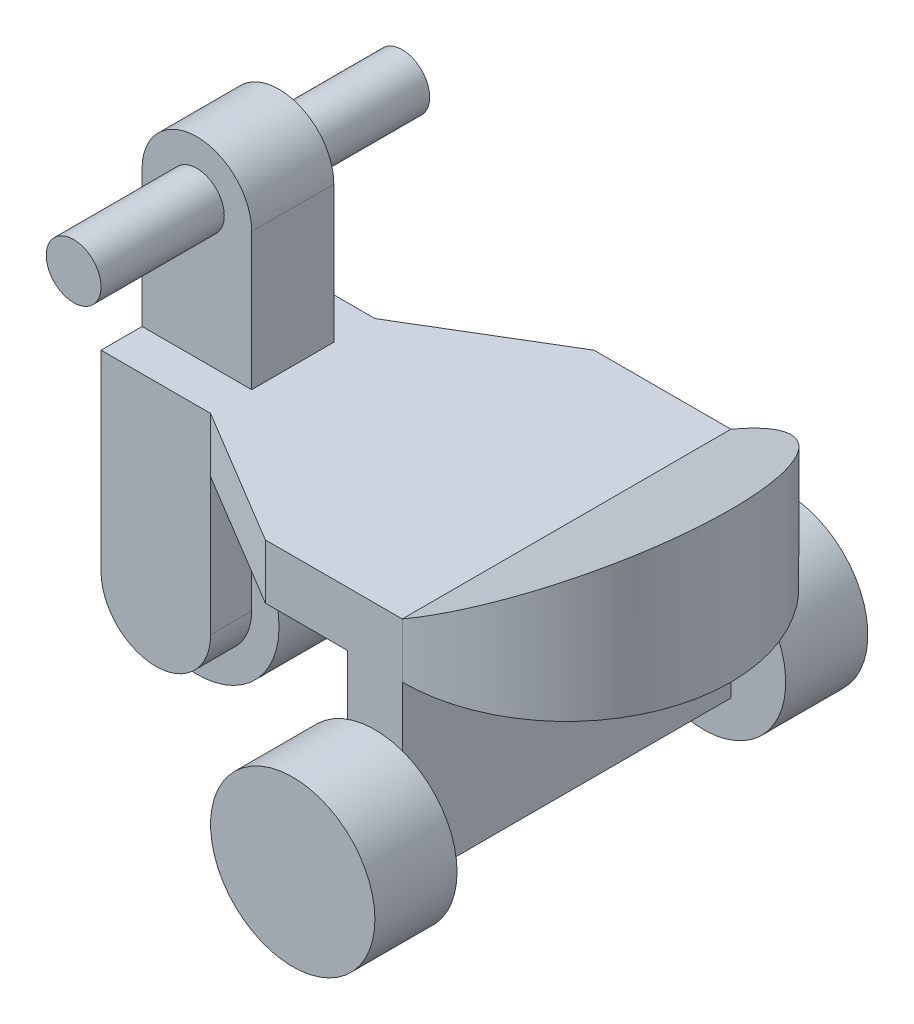
ISO-10303-21;
HEADER;
FILE_DESCRIPTION(('STEP AP214'),'2;1');
FILE_NAME('part.step','',(''),(''),'','','');
FILE_SCHEMA(('AUTOMOTIVE_DESIGN { 1 0 10303 214 1 1 1 1 }'));
ENDSEC;
DATA;
#1=APPLICATION_CONTEXT('core data for automotive mechanical design processes');
#2=APPLICATION_PROTOCOL_DEFINITION('international standard','automotive_design',2000,#1);
#3=PRODUCT_CONTEXT('',#1,'mechanical');
#4=PRODUCT('Part','Part','',(#3));
#5=PRODUCT_RELATED_PRODUCT_CATEGORY('part','',(#4));
#6=PRODUCT_DEFINITION_FORMATION('','',#4);
#7=PRODUCT_DEFINITION_CONTEXT('part definition',#1,'design');
#8=PRODUCT_DEFINITION('design','',#6,#7);
#9=PRODUCT_DEFINITION_SHAPE('','',#8);
#10=(LENGTH_UNIT() NAMED_UNIT(*) SI_UNIT(.MILLI.,.METRE.));
#11=(NAMED_UNIT(*) PLANE_ANGLE_UNIT() SI_UNIT($,.RADIAN.));
#12=(NAMED_UNIT(*) SI_UNIT($,.STERADIAN.) SOLID_ANGLE_UNIT());
#13=UNCERTAINTY_MEASURE_WITH_UNIT(LENGTH_MEASURE(1.E-05),#10,'distance_accuracy_value','');
#14=(GEOMETRIC_REPRESENTATION_CONTEXT(3) GLOBAL_UNCERTAINTY_ASSIGNED_CONTEXT((#13)) GLOBAL_UNIT_ASSIGNED_CONTEXT((#10,
#11,#12)) REPRESENTATION_CONTEXT('',''));
#15=CARTESIAN_POINT('',(0.,0.,0.));
#16=DIRECTION('',(0.,0.,1.));
#17=DIRECTION('',(1.,0.,0.));
#18=AXIS2_PLACEMENT_3D('',#15,#16,#17);
#19=CARTESIAN_POINT('',(-120.,70.,-60.));
#20=DIRECTION('',(0.,0.,1.));
#21=DIRECTION('',(1.,0.,0.));
#22=AXIS2_PLACEMENT_3D('',#19,#20,#21);
#23=CYLINDRICAL_SURFACE('',#22,9.99999999999999);
#24=CARTESIAN_POINT('',(-120.,70.,-60.));
#25=DIRECTION('',(0.,0.,-1.));
#26=DIRECTION('',(-1.,0.,0.));
#27=AXIS2_PLACEMENT_3D('',#24,#25,#26);
#28=CIRCLE('',#27,9.99999999999999);
#29=CARTESIAN_POINT('',(-130.,70.,-60.));
#30=VERTEX_POINT('',#29);
#31=EDGE_CURVE('E11',#30,#30,#28,.T.);
#32=ORIENTED_EDGE('',*,*,#31,.F.);
#33=EDGE_LOOP('',(#32));
#34=FACE_BOUND('',#33,.T.);
#35=CARTESIAN_POINT('',(-120.,70.,-15.));
#36=DIRECTION('',(0.,0.,-1.));
#37=DIRECTION('',(-1.,0.,0.));
#38=AXIS2_PLACEMENT_3D('',#35,#36,#37);
#39=CIRCLE('',#38,9.99999999999999);
#40=CARTESIAN_POINT('',(-130.,70.,-15.));
#41=VERTEX_POINT('',#40);
#42=EDGE_CURVE('E47',#41,#41,#39,.T.);
#43=ORIENTED_EDGE('',*,*,#42,.T.);
#44=EDGE_LOOP('',(#43));
#45=FACE_BOUND('',#44,.T.);
#46=ADVANCED_FACE('F41',(#34,#45),#23,.T.);
#47=CARTESIAN_POINT('',(-120.,70.,-60.));
#48=DIRECTION('',(0.,0.,-1.));
#49=DIRECTION('',(-1.,0.,0.));
#50=AXIS2_PLACEMENT_3D('',#47,#48,#49);
#51=PLANE('',#50);
#52=ORIENTED_EDGE('',*,*,#31,.T.);
#53=EDGE_LOOP('',(#52));
#54=FACE_BOUND('',#53,.T.);
#55=ADVANCED_FACE('F56',(#54),#51,.T.);
#56=CARTESIAN_POINT('',(-120.,70.,-15.));
#57=DIRECTION('',(0.,0.,-1.));
#58=DIRECTION('',(-1.,0.,0.));
#59=AXIS2_PLACEMENT_3D('',#56,#57,#58);
#60=PLANE('',#59);
#61=ORIENTED_EDGE('',*,*,#42,.F.);
#62=EDGE_LOOP('',(#61));
#63=FACE_BOUND('',#62,.T.);
#64=ADVANCED_FACE('F54',(#63),#60,.F.);
#65=CLOSED_SHELL('',(#46,#55,#64));
#66=MANIFOLD_SOLID_BREP('B2',#65);
#67=CARTESIAN_POINT('',(-120.,70.,60.));
#68=DIRECTION('',(0.,0.,-1.));
#69=DIRECTION('',(-1.,0.,0.));
#70=AXIS2_PLACEMENT_3D('',#67,#68,#69);
#71=CYLINDRICAL_SURFACE('',#70,9.99999999999999);
#72=CARTESIAN_POINT('',(-120.,70.,60.));
#73=DIRECTION('',(0.,0.,1.));
#74=DIRECTION('',(1.,0.,0.));
#75=AXIS2_PLACEMENT_3D('',#72,#73,#74);
#76=CIRCLE('',#75,9.99999999999999);
#77=CARTESIAN_POINT('',(-110.,70.,60.));
#78=VERTEX_POINT('',#77);
#79=EDGE_CURVE('E40',#78,#78,#76,.T.);
#80=ORIENTED_EDGE('',*,*,#79,.F.);
#81=EDGE_LOOP('',(#80));
#82=FACE_BOUND('',#81,.T.);
#83=CARTESIAN_POINT('',(-120.,70.,15.));
#84=DIRECTION('',(0.,0.,1.));
#85=DIRECTION('',(1.,0.,0.));
#86=AXIS2_PLACEMENT_3D('',#83,#84,#85);
#87=CIRCLE('',#86,9.99999999999999);
#88=CARTESIAN_POINT('',(-110.,70.,15.));
#89=VERTEX_POINT('',#88);
#90=EDGE_CURVE('E97',#89,#89,#87,.T.);
#91=ORIENTED_EDGE('',*,*,#90,.T.);
#92=EDGE_LOOP('',(#91));
#93=FACE_BOUND('',#92,.T.);
#94=ADVANCED_FACE('F91',(#82,#93),#71,.T.);
#95=CARTESIAN_POINT('',(-120.,70.,60.));
#96=DIRECTION('',(0.,0.,1.));
#97=DIRECTION('',(1.,0.,0.));
#98=AXIS2_PLACEMENT_3D('',#95,#96,#97);
#99=PLANE('',#98);
#100=ORIENTED_EDGE('',*,*,#79,.T.);
#101=EDGE_LOOP('',(#100));
#102=FACE_BOUND('',#101,.T.);
#103=ADVANCED_FACE('F106',(#102),#99,.T.);
#104=CARTESIAN_POINT('',(-120.,70.,15.));
#105=DIRECTION('',(0.,0.,1.));
#106=DIRECTION('',(1.,0.,0.));
#107=AXIS2_PLACEMENT_3D('',#104,#105,#106);
#108=PLANE('',#107);
#109=ORIENTED_EDGE('',*,*,#90,.F.);
#110=EDGE_LOOP('',(#109));
#111=FACE_BOUND('',#110,.T.);
#112=ADVANCED_FACE('F104',(#111),#108,.F.);
#113=CLOSED_SHELL('',(#94,#103,#112));
#114=MANIFOLD_SOLID_BREP('B6',#113);
#115=CARTESIAN_POINT('',(-100.,70.,-15.));
#116=DIRECTION('',(-1.,0.,0.));
#117=DIRECTION('',(0.,0.,1.));
#118=AXIS2_PLACEMENT_3D('',#115,#116,#117);
#119=PLANE('',#118);
#120=DIRECTION('',(0.,-1.,0.));
#121=VECTOR('',#120,1.);
#122=CARTESIAN_POINT('',(-100.,70.,15.));
#123=LINE('',#122,#121);
#124=CARTESIAN_POINT('',(-100.,70.,15.));
#125=VERTEX_POINT('',#124);
#126=CARTESIAN_POINT('',(-100.,0.,15.));
#127=VERTEX_POINT('',#126);
#128=EDGE_CURVE('E180',#125,#127,#123,.T.);
#129=ORIENTED_EDGE('',*,*,#128,.T.);
#130=DIRECTION('',(0.,0.,-1.));
#131=VECTOR('',#130,1.);
#132=CARTESIAN_POINT('',(-100.,0.,-15.));
#133=LINE('',#132,#131);
#134=CARTESIAN_POINT('',(-100.,0.,-15.));
#135=VERTEX_POINT('',#134);
#136=EDGE_CURVE('E198',#127,#135,#133,.T.);
#137=ORIENTED_EDGE('',*,*,#136,.T.);
#138=DIRECTION('',(0.,-1.,0.));
#139=VECTOR('',#138,1.);
#140=CARTESIAN_POINT('',(-100.,70.,-15.));
#141=LINE('',#140,#139);
#142=CARTESIAN_POINT('',(-100.,70.,-15.));
#143=VERTEX_POINT('',#142);
#144=EDGE_CURVE('E89',#143,#135,#141,.T.);
#145=ORIENTED_EDGE('',*,*,#144,.F.);
#146=DIRECTION('',(0.,0.,-1.));
#147=VECTOR('',#146,1.);
#148=CARTESIAN_POINT('',(-100.,70.,-15.));
#149=LINE('',#148,#147);
#150=EDGE_CURVE('E177',#125,#143,#149,.T.);
#151=ORIENTED_EDGE('',*,*,#150,.F.);
#152=EDGE_LOOP('',(#129,#137,#145,#151));
#153=FACE_BOUND('',#152,.T.);
#154=ADVANCED_FACE('F139',(#153),#119,.F.);
#155=CARTESIAN_POINT('',(-100.,70.,-15.));
#156=DIRECTION('',(0.,0.,1.));
#157=DIRECTION('',(1.,0.,0.));
#158=AXIS2_PLACEMENT_3D('',#155,#156,#157);
#159=PLANE('',#158);
#160=DIRECTION('',(0.,-1.,0.));
#161=VECTOR('',#160,1.);
#162=CARTESIAN_POINT('',(-140.,70.,-15.));
#163=LINE('',#162,#161);
#164=CARTESIAN_POINT('',(-140.,70.,-15.));
#165=VERTEX_POINT('',#164);
#166=CARTESIAN_POINT('',(-140.,0.,-15.));
#167=VERTEX_POINT('',#166);
#168=EDGE_CURVE('E146',#165,#167,#163,.T.);
#169=ORIENTED_EDGE('',*,*,#168,.F.);
#170=CARTESIAN_POINT('',(-120.,70.,-15.));
#171=DIRECTION('',(0.,0.,1.));
#172=DIRECTION('',(1.,0.,0.));
#173=AXIS2_PLACEMENT_3D('',#170,#171,#172);
#174=CIRCLE('',#173,20.);
#175=EDGE_CURVE('E196',#143,#165,#174,.T.);
#176=ORIENTED_EDGE('',*,*,#175,.F.);
#177=ORIENTED_EDGE('',*,*,#144,.T.);
#178=DIRECTION('',(-1.,0.,0.));
#179=VECTOR('',#178,1.);
#180=CARTESIAN_POINT('',(-100.,0.,-15.));
#181=LINE('',#180,#179);
#182=EDGE_CURVE('E202',#135,#167,#181,.T.);
#183=ORIENTED_EDGE('',*,*,#182,.T.);
#184=EDGE_LOOP('',(#169,#176,#177,#183));
#185=FACE_BOUND('',#184,.T.);
#186=ADVANCED_FACE('F213',(#185),#159,.F.);
#187=CARTESIAN_POINT('',(-140.,70.,-15.));
#188=DIRECTION('',(1.,0.,0.));
#189=DIRECTION('',(0.,0.,-1.));
#190=AXIS2_PLACEMENT_3D('',#187,#188,#189);
#191=PLANE('',#190);
#192=ORIENTED_EDGE('',*,*,#168,.T.);
#193=DIRECTION('',(0.,0.,1.));
#194=VECTOR('',#193,1.);
#195=CARTESIAN_POINT('',(-140.,0.,-15.));
#196=LINE('',#195,#194);
#197=CARTESIAN_POINT('',(-140.,0.,15.));
#198=VERTEX_POINT('',#197);
#199=EDGE_CURVE('E204',#167,#198,#196,.T.);
#200=ORIENTED_EDGE('',*,*,#199,.T.);
#201=DIRECTION('',(0.,-1.,0.));
#202=VECTOR('',#201,1.);
#203=CARTESIAN_POINT('',(-140.,70.,15.));
#204=LINE('',#203,#202);
#205=CARTESIAN_POINT('',(-140.,70.,15.));
#206=VERTEX_POINT('',#205);
#207=EDGE_CURVE('E153',#206,#198,#204,.T.);
#208=ORIENTED_EDGE('',*,*,#207,.F.);
#209=DIRECTION('',(0.,0.,1.));
#210=VECTOR('',#209,1.);
#211=CARTESIAN_POINT('',(-140.,70.,-15.));
#212=LINE('',#211,#210);
#213=EDGE_CURVE('E185',#165,#206,#212,.T.);
#214=ORIENTED_EDGE('',*,*,#213,.F.);
#215=EDGE_LOOP('',(#192,#200,#208,#214));
#216=FACE_BOUND('',#215,.T.);
#217=ADVANCED_FACE('F209',(#216),#191,.F.);
#218=CARTESIAN_POINT('',(-100.,70.,15.));
#219=DIRECTION('',(0.,0.,-1.));
#220=DIRECTION('',(-1.,0.,0.));
#221=AXIS2_PLACEMENT_3D('',#218,#219,#220);
#222=PLANE('',#221);
#223=ORIENTED_EDGE('',*,*,#128,.F.);
#224=CARTESIAN_POINT('',(-120.,70.,15.));
#225=DIRECTION('',(0.,0.,1.));
#226=DIRECTION('',(1.,0.,0.));
#227=AXIS2_PLACEMENT_3D('',#224,#225,#226);
#228=CIRCLE('',#227,20.);
#229=EDGE_CURVE('E192',#125,#206,#228,.T.);
#230=ORIENTED_EDGE('',*,*,#229,.T.);
#231=ORIENTED_EDGE('',*,*,#207,.T.);
#232=DIRECTION('',(1.,0.,0.));
#233=VECTOR('',#232,1.);
#234=CARTESIAN_POINT('',(-100.,0.,15.));
#235=LINE('',#234,#233);
#236=EDGE_CURVE('E186',#198,#127,#235,.T.);
#237=ORIENTED_EDGE('',*,*,#236,.T.);
#238=EDGE_LOOP('',(#223,#230,#231,#237));
#239=FACE_BOUND('',#238,.T.);
#240=ADVANCED_FACE('F191',(#239),#222,.F.);
#241=CARTESIAN_POINT('',(-100.,0.,15.));
#242=DIRECTION('',(0.,-1.,0.));
#243=DIRECTION('',(0.,0.,-1.));
#244=AXIS2_PLACEMENT_3D('',#241,#242,#243);
#245=PLANE('',#244);
#246=ORIENTED_EDGE('',*,*,#136,.F.);
#247=ORIENTED_EDGE('',*,*,#236,.F.);
#248=ORIENTED_EDGE('',*,*,#199,.F.);
#249=ORIENTED_EDGE('',*,*,#182,.F.);
#250=EDGE_LOOP('',(#246,#247,#248,#249));
#251=FACE_BOUND('',#250,.T.);
#252=ADVANCED_FACE('F212',(#251),#245,.T.);
#253=CARTESIAN_POINT('',(-120.,70.,-15.));
#254=DIRECTION('',(0.,0.,1.));
#255=DIRECTION('',(1.,0.,0.));
#256=AXIS2_PLACEMENT_3D('',#253,#254,#255);
#257=CYLINDRICAL_SURFACE('',#256,20.);
#258=ORIENTED_EDGE('',*,*,#150,.T.);
#259=ORIENTED_EDGE('',*,*,#175,.T.);
#260=ORIENTED_EDGE('',*,*,#213,.T.);
#261=ORIENTED_EDGE('',*,*,#229,.F.);
#262=EDGE_LOOP('',(#258,#259,#260,#261));
#263=FACE_BOUND('',#262,.T.);
#264=ADVANCED_FACE('F195',(#263),#257,.T.);
#265=CLOSED_SHELL('',(#154,#186,#217,#240,#252,#264));
#266=MANIFOLD_SOLID_BREP('B35',#265);
#267=CARTESIAN_POINT('',(-120.,-50.,15.));
#268=DIRECTION('',(0.,0.,-1.));
#269=DIRECTION('',(-1.,0.,0.));
#270=AXIS2_PLACEMENT_3D('',#267,#268,#269);
#271=CYLINDRICAL_SURFACE('',#270,30.);
#272=CARTESIAN_POINT('',(-120.,-50.,15.));
#273=DIRECTION('',(0.,0.,1.));
#274=DIRECTION('',(1.,0.,0.));
#275=AXIS2_PLACEMENT_3D('',#272,#273,#274);
#276=CIRCLE('',#275,30.);
#277=CARTESIAN_POINT('',(-90.,-50.,15.));
#278=VERTEX_POINT('',#277);
#279=EDGE_CURVE('E138',#278,#278,#276,.T.);
#280=ORIENTED_EDGE('',*,*,#279,.F.);
#281=EDGE_LOOP('',(#280));
#282=FACE_BOUND('',#281,.T.);
#283=CARTESIAN_POINT('',(-120.,-50.,-15.));
#284=DIRECTION('',(0.,0.,1.));
#285=DIRECTION('',(1.,0.,0.));
#286=AXIS2_PLACEMENT_3D('',#283,#284,#285);
#287=CIRCLE('',#286,30.);
#288=CARTESIAN_POINT('',(-90.,-50.,-15.));
#289=VERTEX_POINT('',#288);
#290=EDGE_CURVE('E287',#289,#289,#287,.T.);
#291=ORIENTED_EDGE('',*,*,#290,.T.);
#292=EDGE_LOOP('',(#291));
#293=FACE_BOUND('',#292,.T.);
#294=ADVANCED_FACE('F281',(#282,#293),#271,.T.);
#295=CARTESIAN_POINT('',(-120.,-50.,15.));
#296=DIRECTION('',(0.,0.,1.));
#297=DIRECTION('',(1.,0.,0.));
#298=AXIS2_PLACEMENT_3D('',#295,#296,#297);
#299=PLANE('',#298);
#300=ORIENTED_EDGE('',*,*,#279,.T.);
#301=EDGE_LOOP('',(#300));
#302=FACE_BOUND('',#301,.T.);
#303=ADVANCED_FACE('F296',(#302),#299,.T.);
#304=CARTESIAN_POINT('',(-120.,-50.,-15.));
#305=DIRECTION('',(0.,0.,1.));
#306=DIRECTION('',(1.,0.,0.));
#307=AXIS2_PLACEMENT_3D('',#304,#305,#306);
#308=PLANE('',#307);
#309=ORIENTED_EDGE('',*,*,#290,.F.);
#310=EDGE_LOOP('',(#309));
#311=FACE_BOUND('',#310,.T.);
#312=ADVANCED_FACE('F294',(#311),#308,.F.);
#313=CLOSED_SHELL('',(#294,#303,#312));
#314=MANIFOLD_SOLID_BREP('B83',#313);
#315=CARTESIAN_POINT('',(-10.,-50.,-90.));
#316=DIRECTION('',(0.,0.,1.));
#317=DIRECTION('',(1.,0.,0.));
#318=AXIS2_PLACEMENT_3D('',#315,#316,#317);
#319=CYLINDRICAL_SURFACE('',#318,30.);
#320=CARTESIAN_POINT('',(-10.,-50.,-90.));
#321=DIRECTION('',(0.,0.,-1.));
#322=DIRECTION('',(-1.,0.,0.));
#323=AXIS2_PLACEMENT_3D('',#320,#321,#322);
#324=CIRCLE('',#323,30.);
#325=CARTESIAN_POINT('',(-40.,-50.,-90.));
#326=VERTEX_POINT('',#325);
#327=EDGE_CURVE('E280',#326,#326,#324,.T.);
#328=ORIENTED_EDGE('',*,*,#327,.F.);
#329=EDGE_LOOP('',(#328));
#330=FACE_BOUND('',#329,.T.);
#331=CARTESIAN_POINT('',(-9.99999999999999,-50.,-60.));
#332=DIRECTION('',(0.,0.,-1.));
#333=DIRECTION('',(-1.,0.,0.));
#334=AXIS2_PLACEMENT_3D('',#331,#332,#333);
#335=CIRCLE('',#334,30.);
#336=CARTESIAN_POINT('',(-40.,-50.,-60.));
#337=VERTEX_POINT('',#336);
#338=EDGE_CURVE('E335',#337,#337,#335,.T.);
#339=ORIENTED_EDGE('',*,*,#338,.T.);
#340=EDGE_LOOP('',(#339));
#341=FACE_BOUND('',#340,.T.);
#342=ADVANCED_FACE('F329',(#330,#341),#319,.T.);
#343=CARTESIAN_POINT('',(-10.,-50.,-90.));
#344=DIRECTION('',(0.,0.,-1.));
#345=DIRECTION('',(-1.,0.,0.));
#346=AXIS2_PLACEMENT_3D('',#343,#344,#345);
#347=PLANE('',#346);
#348=ORIENTED_EDGE('',*,*,#327,.T.);
#349=EDGE_LOOP('',(#348));
#350=FACE_BOUND('',#349,.T.);
#351=ADVANCED_FACE('F344',(#350),#347,.T.);
#352=CARTESIAN_POINT('',(-9.99999999999999,-50.,-60.));
#353=DIRECTION('',(0.,0.,-1.));
#354=DIRECTION('',(-1.,0.,0.));
#355=AXIS2_PLACEMENT_3D('',#352,#353,#354);
#356=PLANE('',#355);
#357=ORIENTED_EDGE('',*,*,#338,.F.);
#358=EDGE_LOOP('',(#357));
#359=FACE_BOUND('',#358,.T.);
#360=ADVANCED_FACE('F342',(#359),#356,.F.);
#361=CLOSED_SHELL('',(#342,#351,#360));
#362=MANIFOLD_SOLID_BREP('B133',#361);
#363=CARTESIAN_POINT('',(-9.99999999999999,-50.,90.));
#364=DIRECTION('',(0.,0.,-1.));
#365=DIRECTION('',(-1.,0.,0.));
#366=AXIS2_PLACEMENT_3D('',#363,#364,#365);
#367=CYLINDRICAL_SURFACE('',#366,30.);
#368=CARTESIAN_POINT('',(-9.99999999999999,-50.,90.));
#369=DIRECTION('',(0.,0.,1.));
#370=DIRECTION('',(1.,0.,0.));
#371=AXIS2_PLACEMENT_3D('',#368,#369,#370);
#372=CIRCLE('',#371,30.);
#373=CARTESIAN_POINT('',(20.,-50.,90.));
#374=VERTEX_POINT('',#373);
#375=EDGE_CURVE('E328',#374,#374,#372,.T.);
#376=ORIENTED_EDGE('',*,*,#375,.F.);
#377=EDGE_LOOP('',(#376));
#378=FACE_BOUND('',#377,.T.);
#379=CARTESIAN_POINT('',(-9.99999999999999,-50.,60.));
#380=DIRECTION('',(0.,0.,1.));
#381=DIRECTION('',(1.,0.,0.));
#382=AXIS2_PLACEMENT_3D('',#379,#380,#381);
#383=CIRCLE('',#382,30.);
#384=CARTESIAN_POINT('',(20.,-50.,60.));
#385=VERTEX_POINT('',#384);
#386=EDGE_CURVE('E384',#385,#385,#383,.T.);
#387=ORIENTED_EDGE('',*,*,#386,.T.);
#388=EDGE_LOOP('',(#387));
#389=FACE_BOUND('',#388,.T.);
#390=ADVANCED_FACE('F378',(#378,#389),#367,.T.);
#391=CARTESIAN_POINT('',(-9.99999999999999,-50.,90.));
#392=DIRECTION('',(0.,0.,1.));
#393=DIRECTION('',(1.,0.,0.));
#394=AXIS2_PLACEMENT_3D('',#391,#392,#393);
#395=PLANE('',#394);
#396=ORIENTED_EDGE('',*,*,#375,.T.);
#397=EDGE_LOOP('',(#396));
#398=FACE_BOUND('',#397,.T.);
#399=ADVANCED_FACE('F393',(#398),#395,.T.);
#400=CARTESIAN_POINT('',(-9.99999999999999,-50.,60.));
#401=DIRECTION('',(0.,0.,1.));
#402=DIRECTION('',(1.,0.,0.));
#403=AXIS2_PLACEMENT_3D('',#400,#401,#402);
#404=PLANE('',#403);
#405=ORIENTED_EDGE('',*,*,#386,.F.);
#406=EDGE_LOOP('',(#405));
#407=FACE_BOUND('',#406,.T.);
#408=ADVANCED_FACE('F391',(#407),#404,.F.);
#409=CLOSED_SHELL('',(#390,#399,#408));
#410=MANIFOLD_SOLID_BREP('B275',#409);
#411=CARTESIAN_POINT('',(0.,0.,0.));
#412=DIRECTION('',(0.,1.,0.));
#413=DIRECTION('',(0.,0.,1.));
#414=AXIS2_PLACEMENT_3D('',#411,#412,#413);
#415=PLANE('',#414);
#416=DIRECTION('',(0.,0.,1.));
#417=VECTOR('',#416,1.);
#418=CARTESIAN_POINT('',(0.,0.,0.));
#419=LINE('',#418,#417);
#420=CARTESIAN_POINT('',(0.,0.,-60.));
#421=VERTEX_POINT('',#420);
#422=CARTESIAN_POINT('',(0.,0.,60.));
#423=VERTEX_POINT('',#422);
#424=EDGE_CURVE('E589',#421,#423,#419,.T.);
#425=ORIENTED_EDGE('',*,*,#424,.F.);
#426=CARTESIAN_POINT('',(0.,0.,0.));
#427=DIRECTION('',(0.,1.,0.));
#428=DIRECTION('',(0.,0.,1.));
#429=AXIS2_PLACEMENT_3D('',#426,#427,#428);
#430=CIRCLE('',#429,60.);
#431=EDGE_CURVE('E627',#423,#421,#430,.T.);
#432=ORIENTED_EDGE('',*,*,#431,.F.);
#433=EDGE_LOOP('',(#425,#432));
#434=FACE_BOUND('',#433,.T.);
#435=ADVANCED_FACE('F418',(#434),#415,.F.);
#436=DIRECTION('',(-1.,0.,0.));
#437=VECTOR('',#436,1.);
#438=CARTESIAN_POINT('',(0.,0.,-60.));
#439=LINE('',#438,#437);
#440=CARTESIAN_POINT('',(-20.,0.,-60.));
#441=VERTEX_POINT('',#440);
#442=CARTESIAN_POINT('',(-50.,0.,-60.));
#443=VERTEX_POINT('',#442);
#444=EDGE_CURVE('E630',#441,#443,#439,.T.);
#445=ORIENTED_EDGE('',*,*,#444,.F.);
#446=DIRECTION('',(0.,0.,1.));
#447=VECTOR('',#446,1.);
#448=CARTESIAN_POINT('',(-20.,0.,0.));
#449=LINE('',#448,#447);
#450=CARTESIAN_POINT('',(-20.,0.,60.));
#451=VERTEX_POINT('',#450);
#452=EDGE_CURVE('E586',#441,#451,#449,.T.);
#453=ORIENTED_EDGE('',*,*,#452,.T.);
#454=DIRECTION('',(1.,0.,0.));
#455=VECTOR('',#454,1.);
#456=CARTESIAN_POINT('',(0.,0.,60.));
#457=LINE('',#456,#455);
#458=CARTESIAN_POINT('',(-50.,0.,60.));
#459=VERTEX_POINT('',#458);
#460=EDGE_CURVE('E640',#459,#451,#457,.T.);
#461=ORIENTED_EDGE('',*,*,#460,.F.);
#462=DIRECTION('',(0.857492925712544,0.,0.514495755427526));
#463=VECTOR('',#462,1.);
#464=CARTESIAN_POINT('',(-100.,0.,30.));
#465=LINE('',#464,#463);
#466=CARTESIAN_POINT('',(-100.,0.,30.));
#467=VERTEX_POINT('',#466);
#468=EDGE_CURVE('E638',#467,#459,#465,.T.);
#469=ORIENTED_EDGE('',*,*,#468,.F.);
#470=DIRECTION('',(0.,0.,1.));
#471=VECTOR('',#470,1.);
#472=CARTESIAN_POINT('',(-100.,0.,0.));
#473=LINE('',#472,#471);
#474=CARTESIAN_POINT('',(-100.,0.,15.));
#475=VERTEX_POINT('',#474);
#476=EDGE_CURVE('E607',#475,#467,#473,.T.);
#477=ORIENTED_EDGE('',*,*,#476,.F.);
#478=DIRECTION('',(0.,0.,1.));
#479=VECTOR('',#478,1.);
#480=CARTESIAN_POINT('',(-100.,0.,-15.));
#481=LINE('',#480,#479);
#482=CARTESIAN_POINT('',(-100.,0.,-15.));
#483=VERTEX_POINT('',#482);
#484=EDGE_CURVE('E635',#483,#475,#481,.T.);
#485=ORIENTED_EDGE('',*,*,#484,.F.);
#486=DIRECTION('',(0.,0.,-1.));
#487=VECTOR('',#486,1.);
#488=CARTESIAN_POINT('',(-100.,0.,0.));
#489=LINE('',#488,#487);
#490=CARTESIAN_POINT('',(-100.,0.,-30.));
#491=VERTEX_POINT('',#490);
#492=EDGE_CURVE('E600',#483,#491,#489,.T.);
#493=ORIENTED_EDGE('',*,*,#492,.T.);
#494=DIRECTION('',(-0.857492925712544,0.,0.514495755427526));
#495=VECTOR('',#494,1.);
#496=CARTESIAN_POINT('',(-50.,0.,-60.));
#497=LINE('',#496,#495);
#498=EDGE_CURVE('E632',#443,#491,#497,.T.);
#499=ORIENTED_EDGE('',*,*,#498,.F.);
#500=EDGE_LOOP('',(#445,#453,#461,#469,#477,#485,#493,#499));
#501=FACE_BOUND('',#500,.T.);
#502=ADVANCED_FACE('F695',(#501),#415,.F.);
#503=CARTESIAN_POINT('',(0.,20.,0.));
#504=DIRECTION('',(0.,-1.,0.));
#505=DIRECTION('',(0.,0.,-1.));
#506=AXIS2_PLACEMENT_3D('',#503,#504,#505);
#507=CYLINDRICAL_SURFACE('',#506,60.);
#508=DIRECTION('',(0.,-1.,0.));
#509=VECTOR('',#508,1.);
#510=CARTESIAN_POINT('',(0.,20.,-60.));
#511=LINE('',#510,#509);
#512=CARTESIAN_POINT('',(0.,20.,-60.));
#513=VERTEX_POINT('',#512);
#514=EDGE_CURVE('E376',#513,#421,#511,.T.);
#515=ORIENTED_EDGE('',*,*,#514,.F.);
#516=CARTESIAN_POINT('',(0.,20.,0.));
#517=DIRECTION('',(0.500000000000001,-0.866025403784438,0.));
#518=DIRECTION('',(-0.866025403784438,-0.500000000000001,0.));
#519=AXIS2_PLACEMENT_3D('',#516,#517,#518);
#520=ELLIPSE('',#519,69.2820323027551,60.);
#521=CARTESIAN_POINT('',(0.,20.,60.));
#522=VERTEX_POINT('',#521);
#523=EDGE_CURVE('E622',#513,#522,#520,.T.);
#524=ORIENTED_EDGE('',*,*,#523,.T.);
#525=DIRECTION('',(0.,-1.,0.));
#526=VECTOR('',#525,1.);
#527=CARTESIAN_POINT('',(0.,20.,60.));
#528=LINE('',#527,#526);
#529=EDGE_CURVE('E662',#522,#423,#528,.T.);
#530=ORIENTED_EDGE('',*,*,#529,.T.);
#531=ORIENTED_EDGE('',*,*,#431,.T.);
#532=EDGE_LOOP('',(#515,#524,#530,#531));
#533=FACE_BOUND('',#532,.T.);
#534=ADVANCED_FACE('F420',(#533),#507,.T.);
#535=CARTESIAN_POINT('',(0.,20.,-60.));
#536=DIRECTION('',(0.,0.,1.));
#537=DIRECTION('',(1.,0.,0.));
#538=AXIS2_PLACEMENT_3D('',#535,#536,#537);
#539=PLANE('',#538);
#540=ORIENTED_EDGE('',*,*,#514,.T.);
#541=DIRECTION('',(0.,1.,0.));
#542=VECTOR('',#541,1.);
#543=CARTESIAN_POINT('',(0.,-50.,-60.));
#544=LINE('',#543,#542);
#545=CARTESIAN_POINT('',(0.,-65.,-60.));
#546=VERTEX_POINT('',#545);
#547=EDGE_CURVE('E596',#546,#421,#544,.T.);
#548=ORIENTED_EDGE('',*,*,#547,.F.);
#549=DIRECTION('',(1.,0.,0.));
#550=VECTOR('',#549,1.);
#551=CARTESIAN_POINT('',(-20.,-65.,-60.));
#552=LINE('',#551,#550);
#553=CARTESIAN_POINT('',(-20.,-65.,-60.));
#554=VERTEX_POINT('',#553);
#555=EDGE_CURVE('E577',#554,#546,#552,.T.);
#556=ORIENTED_EDGE('',*,*,#555,.F.);
#557=DIRECTION('',(0.,1.,0.));
#558=VECTOR('',#557,1.);
#559=CARTESIAN_POINT('',(-20.,-50.,-60.));
#560=LINE('',#559,#558);
#561=EDGE_CURVE('E598',#554,#441,#560,.T.);
#562=ORIENTED_EDGE('',*,*,#561,.T.);
#563=ORIENTED_EDGE('',*,*,#444,.T.);
#564=DIRECTION('',(0.,-1.,0.));
#565=VECTOR('',#564,1.);
#566=CARTESIAN_POINT('',(-50.,20.,-60.));
#567=LINE('',#566,#565);
#568=CARTESIAN_POINT('',(-50.,20.,-60.));
#569=VERTEX_POINT('',#568);
#570=EDGE_CURVE('E426',#569,#443,#567,.T.);
#571=ORIENTED_EDGE('',*,*,#570,.F.);
#572=DIRECTION('',(-1.,0.,0.));
#573=VECTOR('',#572,1.);
#574=CARTESIAN_POINT('',(0.,20.,-60.));
#575=LINE('',#574,#573);
#576=EDGE_CURVE('E643',#513,#569,#575,.T.);
#577=ORIENTED_EDGE('',*,*,#576,.F.);
#578=EDGE_LOOP('',(#540,#548,#556,#562,#563,#571,#577));
#579=FACE_BOUND('',#578,.T.);
#580=ADVANCED_FACE('F717',(#579),#539,.F.);
#581=CARTESIAN_POINT('',(-50.,20.,-60.));
#582=DIRECTION('',(0.514495755427526,0.,0.857492925712544));
#583=DIRECTION('',(0.857492925712544,0.,-0.514495755427526));
#584=AXIS2_PLACEMENT_3D('',#581,#582,#583);
#585=PLANE('',#584);
#586=ORIENTED_EDGE('',*,*,#498,.T.);
#587=DIRECTION('',(0.,-1.,0.));
#588=VECTOR('',#587,1.);
#589=CARTESIAN_POINT('',(-100.,20.,-30.));
#590=LINE('',#589,#588);
#591=CARTESIAN_POINT('',(-100.,20.,-30.));
#592=VERTEX_POINT('',#591);
#593=EDGE_CURVE('E682',#592,#491,#590,.T.);
#594=ORIENTED_EDGE('',*,*,#593,.F.);
#595=DIRECTION('',(-0.857492925712544,0.,0.514495755427526));
#596=VECTOR('',#595,1.);
#597=CARTESIAN_POINT('',(-50.,20.,-60.));
#598=LINE('',#597,#596);
#599=EDGE_CURVE('E645',#569,#592,#598,.T.);
#600=ORIENTED_EDGE('',*,*,#599,.F.);
#601=ORIENTED_EDGE('',*,*,#570,.T.);
#602=EDGE_LOOP('',(#586,#594,#600,#601));
#603=FACE_BOUND('',#602,.T.);
#604=ADVANCED_FACE('F689',(#603),#585,.F.);
#605=CARTESIAN_POINT('',(-100.,20.,-30.));
#606=DIRECTION('',(0.,0.,1.));
#607=DIRECTION('',(1.,0.,0.));
#608=AXIS2_PLACEMENT_3D('',#605,#606,#607);
#609=PLANE('',#608);
#610=DIRECTION('',(0.,1.,0.));
#611=VECTOR('',#610,1.);
#612=CARTESIAN_POINT('',(-100.,-50.,-30.));
#613=LINE('',#612,#611);
#614=CARTESIAN_POINT('',(-100.,-50.,-30.));
#615=VERTEX_POINT('',#614);
#616=EDGE_CURVE('E549',#615,#491,#613,.T.);
#617=ORIENTED_EDGE('',*,*,#616,.F.);
#618=CARTESIAN_POINT('',(-120.,-50.,-30.));
#619=DIRECTION('',(0.,0.,1.));
#620=DIRECTION('',(1.,0.,0.));
#621=AXIS2_PLACEMENT_3D('',#618,#619,#620);
#622=CIRCLE('',#621,20.);
#623=CARTESIAN_POINT('',(-140.,-50.,-30.));
#624=VERTEX_POINT('',#623);
#625=EDGE_CURVE('E564',#624,#615,#622,.T.);
#626=ORIENTED_EDGE('',*,*,#625,.F.);
#627=DIRECTION('',(0.,-1.,0.));
#628=VECTOR('',#627,1.);
#629=CARTESIAN_POINT('',(-140.,20.,-30.));
#630=LINE('',#629,#628);
#631=CARTESIAN_POINT('',(-140.,20.,-30.));
#632=VERTEX_POINT('',#631);
#633=EDGE_CURVE('E544',#632,#624,#630,.T.);
#634=ORIENTED_EDGE('',*,*,#633,.F.);
#635=DIRECTION('',(-1.,0.,0.));
#636=VECTOR('',#635,1.);
#637=CARTESIAN_POINT('',(-100.,20.,-30.));
#638=LINE('',#637,#636);
#639=EDGE_CURVE('E647',#592,#632,#638,.T.);
#640=ORIENTED_EDGE('',*,*,#639,.F.);
#641=ORIENTED_EDGE('',*,*,#593,.T.);
#642=EDGE_LOOP('',(#617,#626,#634,#640,#641));
#643=FACE_BOUND('',#642,.T.);
#644=ADVANCED_FACE('F709',(#643),#609,.F.);
#645=CARTESIAN_POINT('',(-140.,20.,-30.));
#646=DIRECTION('',(1.,0.,0.));
#647=DIRECTION('',(0.,0.,-1.));
#648=AXIS2_PLACEMENT_3D('',#645,#646,#647);
#649=PLANE('',#648);
#650=ORIENTED_EDGE('',*,*,#633,.T.);
#651=DIRECTION('',(0.,0.,-1.));
#652=VECTOR('',#651,1.);
#653=CARTESIAN_POINT('',(-140.,-50.,0.));
#654=LINE('',#653,#652);
#655=CARTESIAN_POINT('',(-140.,-50.,-15.));
#656=VERTEX_POINT('',#655);
#657=EDGE_CURVE('E537',#656,#624,#654,.T.);
#658=ORIENTED_EDGE('',*,*,#657,.F.);
#659=DIRECTION('',(0.,-1.,0.));
#660=VECTOR('',#659,1.);
#661=CARTESIAN_POINT('',(-140.,20.,-15.));
#662=LINE('',#661,#660);
#663=CARTESIAN_POINT('',(-140.,20.,-15.));
#664=VERTEX_POINT('',#663);
#665=EDGE_CURVE('E541',#664,#656,#662,.T.);
#666=ORIENTED_EDGE('',*,*,#665,.F.);
#667=DIRECTION('',(0.,0.,1.));
#668=VECTOR('',#667,1.);
#669=CARTESIAN_POINT('',(-140.,20.,-30.));
#670=LINE('',#669,#668);
#671=EDGE_CURVE('E649',#632,#664,#670,.T.);
#672=ORIENTED_EDGE('',*,*,#671,.F.);
#673=EDGE_LOOP('',(#650,#658,#666,#672));
#674=FACE_BOUND('',#673,.T.);
#675=ADVANCED_FACE('F539',(#674),#649,.F.);
#676=CARTESIAN_POINT('',(-100.,20.,-15.));
#677=DIRECTION('',(0.,0.,-1.));
#678=DIRECTION('',(-1.,0.,0.));
#679=AXIS2_PLACEMENT_3D('',#676,#677,#678);
#680=PLANE('',#679);
#681=ORIENTED_EDGE('',*,*,#665,.T.);
#682=CARTESIAN_POINT('',(-120.,-50.,-15.));
#683=DIRECTION('',(0.,0.,1.));
#684=DIRECTION('',(1.,0.,0.));
#685=AXIS2_PLACEMENT_3D('',#682,#683,#684);
#686=CIRCLE('',#685,20.);
#687=CARTESIAN_POINT('',(-100.,-50.,-15.));
#688=VERTEX_POINT('',#687);
#689=EDGE_CURVE('E556',#656,#688,#686,.T.);
#690=ORIENTED_EDGE('',*,*,#689,.T.);
#691=DIRECTION('',(0.,1.,0.));
#692=VECTOR('',#691,1.);
#693=CARTESIAN_POINT('',(-100.,-50.,-15.));
#694=LINE('',#693,#692);
#695=EDGE_CURVE('E605',#688,#483,#694,.T.);
#696=ORIENTED_EDGE('',*,*,#695,.T.);
#697=DIRECTION('',(0.,-1.,0.));
#698=VECTOR('',#697,1.);
#699=CARTESIAN_POINT('',(-100.,20.,-15.));
#700=LINE('',#699,#698);
#701=CARTESIAN_POINT('',(-100.,20.,-15.));
#702=VERTEX_POINT('',#701);
#703=EDGE_CURVE('E559',#702,#483,#700,.T.);
#704=ORIENTED_EDGE('',*,*,#703,.F.);
#705=DIRECTION('',(1.,0.,0.));
#706=VECTOR('',#705,1.);
#707=CARTESIAN_POINT('',(-100.,20.,-15.));
#708=LINE('',#707,#706);
#709=EDGE_CURVE('E558',#664,#702,#708,.T.);
#710=ORIENTED_EDGE('',*,*,#709,.F.);
#711=EDGE_LOOP('',(#681,#690,#696,#704,#710));
#712=FACE_BOUND('',#711,.T.);
#713=ADVANCED_FACE('F554',(#712),#680,.F.);
#714=CARTESIAN_POINT('',(-100.,20.,-15.));
#715=DIRECTION('',(1.,0.,0.));
#716=DIRECTION('',(0.,0.,-1.));
#717=AXIS2_PLACEMENT_3D('',#714,#715,#716);
#718=PLANE('',#717);
#719=ORIENTED_EDGE('',*,*,#484,.T.);
#720=DIRECTION('',(0.,-1.,0.));
#721=VECTOR('',#720,1.);
#722=CARTESIAN_POINT('',(-100.,20.,15.));
#723=LINE('',#722,#721);
#724=CARTESIAN_POINT('',(-100.,20.,15.));
#725=VERTEX_POINT('',#724);
#726=EDGE_CURVE('E676',#725,#475,#723,.T.);
#727=ORIENTED_EDGE('',*,*,#726,.F.);
#728=DIRECTION('',(0.,0.,1.));
#729=VECTOR('',#728,1.);
#730=CARTESIAN_POINT('',(-100.,20.,-15.));
#731=LINE('',#730,#729);
#732=EDGE_CURVE('E652',#702,#725,#731,.T.);
#733=ORIENTED_EDGE('',*,*,#732,.F.);
#734=ORIENTED_EDGE('',*,*,#703,.T.);
#735=EDGE_LOOP('',(#719,#727,#733,#734));
#736=FACE_BOUND('',#735,.T.);
#737=ADVANCED_FACE('F701',(#736),#718,.F.);
#738=CARTESIAN_POINT('',(-100.,20.,15.));
#739=DIRECTION('',(0.,0.,1.));
#740=DIRECTION('',(1.,0.,0.));
#741=AXIS2_PLACEMENT_3D('',#738,#739,#740);
#742=PLANE('',#741);
#743=DIRECTION('',(0.,1.,0.));
#744=VECTOR('',#743,1.);
#745=CARTESIAN_POINT('',(-100.,-50.,15.));
#746=LINE('',#745,#744);
#747=CARTESIAN_POINT('',(-100.,-50.,15.));
#748=VERTEX_POINT('',#747);
#749=EDGE_CURVE('E619',#748,#475,#746,.T.);
#750=ORIENTED_EDGE('',*,*,#749,.F.);
#751=CARTESIAN_POINT('',(-120.,-50.,15.));
#752=DIRECTION('',(0.,0.,1.));
#753=DIRECTION('',(1.,0.,0.));
#754=AXIS2_PLACEMENT_3D('',#751,#752,#753);
#755=CIRCLE('',#754,20.);
#756=CARTESIAN_POINT('',(-140.,-50.,15.));
#757=VERTEX_POINT('',#756);
#758=EDGE_CURVE('E571',#757,#748,#755,.T.);
#759=ORIENTED_EDGE('',*,*,#758,.F.);
#760=DIRECTION('',(0.,-1.,0.));
#761=VECTOR('',#760,1.);
#762=CARTESIAN_POINT('',(-140.,20.,15.));
#763=LINE('',#762,#761);
#764=CARTESIAN_POINT('',(-140.,20.,15.));
#765=VERTEX_POINT('',#764);
#766=EDGE_CURVE('E674',#765,#757,#763,.T.);
#767=ORIENTED_EDGE('',*,*,#766,.F.);
#768=DIRECTION('',(-1.,0.,0.));
#769=VECTOR('',#768,1.);
#770=CARTESIAN_POINT('',(-100.,20.,15.));
#771=LINE('',#770,#769);
#772=EDGE_CURVE('E654',#725,#765,#771,.T.);
#773=ORIENTED_EDGE('',*,*,#772,.F.);
#774=ORIENTED_EDGE('',*,*,#726,.T.);
#775=EDGE_LOOP('',(#750,#759,#767,#773,#774));
#776=FACE_BOUND('',#775,.T.);
#777=ADVANCED_FACE('F747',(#776),#742,.F.);
#778=CARTESIAN_POINT('',(-140.,20.,15.));
#779=DIRECTION('',(1.,0.,0.));
#780=DIRECTION('',(0.,0.,-1.));
#781=AXIS2_PLACEMENT_3D('',#778,#779,#780);
#782=PLANE('',#781);
#783=ORIENTED_EDGE('',*,*,#766,.T.);
#784=DIRECTION('',(0.,0.,-1.));
#785=VECTOR('',#784,1.);
#786=CARTESIAN_POINT('',(-140.,-50.,0.));
#787=LINE('',#786,#785);
#788=CARTESIAN_POINT('',(-140.,-50.,30.));
#789=VERTEX_POINT('',#788);
#790=EDGE_CURVE('E613',#789,#757,#787,.T.);
#791=ORIENTED_EDGE('',*,*,#790,.F.);
#792=DIRECTION('',(0.,-1.,0.));
#793=VECTOR('',#792,1.);
#794=CARTESIAN_POINT('',(-140.,20.,30.));
#795=LINE('',#794,#793);
#796=CARTESIAN_POINT('',(-140.,20.,30.));
#797=VERTEX_POINT('',#796);
#798=EDGE_CURVE('E671',#797,#789,#795,.T.);
#799=ORIENTED_EDGE('',*,*,#798,.F.);
#800=DIRECTION('',(0.,0.,1.));
#801=VECTOR('',#800,1.);
#802=CARTESIAN_POINT('',(-140.,20.,15.));
#803=LINE('',#802,#801);
#804=EDGE_CURVE('E656',#765,#797,#803,.T.);
#805=ORIENTED_EDGE('',*,*,#804,.F.);
#806=EDGE_LOOP('',(#783,#791,#799,#805));
#807=FACE_BOUND('',#806,.T.);
#808=ADVANCED_FACE('F743',(#807),#782,.F.);
#809=CARTESIAN_POINT('',(-100.,20.,30.));
#810=DIRECTION('',(0.,0.,-1.));
#811=DIRECTION('',(-1.,0.,0.));
#812=AXIS2_PLACEMENT_3D('',#809,#810,#811);
#813=PLANE('',#812);
#814=ORIENTED_EDGE('',*,*,#798,.T.);
#815=CARTESIAN_POINT('',(-120.,-50.,30.));
#816=DIRECTION('',(0.,0.,1.));
#817=DIRECTION('',(1.,0.,0.));
#818=AXIS2_PLACEMENT_3D('',#815,#816,#817);
#819=CIRCLE('',#818,20.);
#820=CARTESIAN_POINT('',(-100.,-50.,30.));
#821=VERTEX_POINT('',#820);
#822=EDGE_CURVE('E566',#789,#821,#819,.T.);
#823=ORIENTED_EDGE('',*,*,#822,.T.);
#824=DIRECTION('',(0.,1.,0.));
#825=VECTOR('',#824,1.);
#826=CARTESIAN_POINT('',(-100.,-50.,30.));
#827=LINE('',#826,#825);
#828=EDGE_CURVE('E616',#821,#467,#827,.T.);
#829=ORIENTED_EDGE('',*,*,#828,.T.);
#830=DIRECTION('',(0.,-1.,0.));
#831=VECTOR('',#830,1.);
#832=CARTESIAN_POINT('',(-100.,20.,30.));
#833=LINE('',#832,#831);
#834=CARTESIAN_POINT('',(-100.,20.,30.));
#835=VERTEX_POINT('',#834);
#836=EDGE_CURVE('E668',#835,#467,#833,.T.);
#837=ORIENTED_EDGE('',*,*,#836,.F.);
#838=DIRECTION('',(1.,0.,0.));
#839=VECTOR('',#838,1.);
#840=CARTESIAN_POINT('',(-100.,20.,30.));
#841=LINE('',#840,#839);
#842=EDGE_CURVE('E438',#797,#835,#841,.T.);
#843=ORIENTED_EDGE('',*,*,#842,.F.);
#844=EDGE_LOOP('',(#814,#823,#829,#837,#843));
#845=FACE_BOUND('',#844,.T.);
#846=ADVANCED_FACE('F739',(#845),#813,.F.);
#847=CARTESIAN_POINT('',(-100.,20.,30.));
#848=DIRECTION('',(0.514495755427526,0.,-0.857492925712544));
#849=DIRECTION('',(-0.857492925712544,0.,-0.514495755427526));
#850=AXIS2_PLACEMENT_3D('',#847,#848,#849);
#851=PLANE('',#850);
#852=ORIENTED_EDGE('',*,*,#468,.T.);
#853=DIRECTION('',(0.,-1.,0.));
#854=VECTOR('',#853,1.);
#855=CARTESIAN_POINT('',(-50.,20.,60.));
#856=LINE('',#855,#854);
#857=CARTESIAN_POINT('',(-50.,20.,60.));
#858=VERTEX_POINT('',#857);
#859=EDGE_CURVE('E665',#858,#459,#856,.T.);
#860=ORIENTED_EDGE('',*,*,#859,.F.);
#861=DIRECTION('',(0.857492925712544,0.,0.514495755427526));
#862=VECTOR('',#861,1.);
#863=CARTESIAN_POINT('',(-100.,20.,30.));
#864=LINE('',#863,#862);
#865=EDGE_CURVE('E433',#835,#858,#864,.T.);
#866=ORIENTED_EDGE('',*,*,#865,.F.);
#867=ORIENTED_EDGE('',*,*,#836,.T.);
#868=EDGE_LOOP('',(#852,#860,#866,#867));
#869=FACE_BOUND('',#868,.T.);
#870=ADVANCED_FACE('F735',(#869),#851,.F.);
#871=CARTESIAN_POINT('',(0.,20.,60.));
#872=DIRECTION('',(0.,0.,-1.));
#873=DIRECTION('',(-1.,0.,0.));
#874=AXIS2_PLACEMENT_3D('',#871,#872,#873);
#875=PLANE('',#874);
#876=ORIENTED_EDGE('',*,*,#460,.T.);
#877=DIRECTION('',(0.,1.,0.));
#878=VECTOR('',#877,1.);
#879=CARTESIAN_POINT('',(-20.,-50.,60.));
#880=LINE('',#879,#878);
#881=CARTESIAN_POINT('',(-20.,-65.,60.));
#882=VERTEX_POINT('',#881);
#883=EDGE_CURVE('E592',#882,#451,#880,.T.);
#884=ORIENTED_EDGE('',*,*,#883,.F.);
#885=DIRECTION('',(-1.,0.,0.));
#886=VECTOR('',#885,1.);
#887=CARTESIAN_POINT('',(-20.,-65.,60.));
#888=LINE('',#887,#886);
#889=CARTESIAN_POINT('',(0.,-65.,60.));
#890=VERTEX_POINT('',#889);
#891=EDGE_CURVE('E583',#890,#882,#888,.T.);
#892=ORIENTED_EDGE('',*,*,#891,.F.);
#893=DIRECTION('',(0.,1.,0.));
#894=VECTOR('',#893,1.);
#895=CARTESIAN_POINT('',(0.,-50.,60.));
#896=LINE('',#895,#894);
#897=EDGE_CURVE('E594',#890,#423,#896,.T.);
#898=ORIENTED_EDGE('',*,*,#897,.T.);
#899=ORIENTED_EDGE('',*,*,#529,.F.);
#900=DIRECTION('',(1.,0.,0.));
#901=VECTOR('',#900,1.);
#902=CARTESIAN_POINT('',(0.,20.,60.));
#903=LINE('',#902,#901);
#904=EDGE_CURVE('E660',#858,#522,#903,.T.);
#905=ORIENTED_EDGE('',*,*,#904,.F.);
#906=ORIENTED_EDGE('',*,*,#859,.T.);
#907=EDGE_LOOP('',(#876,#884,#892,#898,#899,#905,#906));
#908=FACE_BOUND('',#907,.T.);
#909=ADVANCED_FACE('F732',(#908),#875,.F.);
#910=CARTESIAN_POINT('',(0.,20.,0.));
#911=DIRECTION('',(0.,1.,0.));
#912=DIRECTION('',(0.,0.,1.));
#913=AXIS2_PLACEMENT_3D('',#910,#911,#912);
#914=PLANE('',#913);
#915=DIRECTION('',(0.,0.,1.));
#916=VECTOR('',#915,1.);
#917=CARTESIAN_POINT('',(0.,20.,-60.));
#918=LINE('',#917,#916);
#919=EDGE_CURVE('E625',#513,#522,#918,.T.);
#920=ORIENTED_EDGE('',*,*,#919,.F.);
#921=ORIENTED_EDGE('',*,*,#576,.T.);
#922=ORIENTED_EDGE('',*,*,#599,.T.);
#923=ORIENTED_EDGE('',*,*,#639,.T.);
#924=ORIENTED_EDGE('',*,*,#671,.T.);
#925=ORIENTED_EDGE('',*,*,#709,.T.);
#926=ORIENTED_EDGE('',*,*,#732,.T.);
#927=ORIENTED_EDGE('',*,*,#772,.T.);
#928=ORIENTED_EDGE('',*,*,#804,.T.);
#929=ORIENTED_EDGE('',*,*,#842,.T.);
#930=ORIENTED_EDGE('',*,*,#865,.T.);
#931=ORIENTED_EDGE('',*,*,#904,.T.);
#932=EDGE_LOOP('',(#920,#921,#922,#923,#924,#925,#926,#927,#928,#929,#930,#931));
#933=FACE_BOUND('',#932,.T.);
#934=ADVANCED_FACE('F705',(#933),#914,.T.);
#935=CARTESIAN_POINT('',(0.,20.,-60.));
#936=DIRECTION('',(0.500000000000001,-0.866025403784438,0.));
#937=DIRECTION('',(0.866025403784438,0.500000000000001,0.));
#938=AXIS2_PLACEMENT_3D('',#935,#936,#937);
#939=PLANE('',#938);
#940=ORIENTED_EDGE('',*,*,#919,.T.);
#941=ORIENTED_EDGE('',*,*,#523,.F.);
#942=EDGE_LOOP('',(#940,#941));
#943=FACE_BOUND('',#942,.T.);
#944=ADVANCED_FACE('F728',(#943),#939,.F.);
#945=CARTESIAN_POINT('',(-100.,-50.,0.));
#946=DIRECTION('',(-1.,0.,0.));
#947=DIRECTION('',(0.,0.,1.));
#948=AXIS2_PLACEMENT_3D('',#945,#946,#947);
#949=PLANE('',#948);
#950=ORIENTED_EDGE('',*,*,#476,.T.);
#951=ORIENTED_EDGE('',*,*,#828,.F.);
#952=DIRECTION('',(0.,0.,1.));
#953=VECTOR('',#952,1.);
#954=CARTESIAN_POINT('',(-100.,-50.,0.));
#955=LINE('',#954,#953);
#956=EDGE_CURVE('E610',#748,#821,#955,.T.);
#957=ORIENTED_EDGE('',*,*,#956,.F.);
#958=ORIENTED_EDGE('',*,*,#749,.T.);
#959=EDGE_LOOP('',(#950,#951,#957,#958));
#960=FACE_BOUND('',#959,.T.);
#961=ADVANCED_FACE('F799',(#960),#949,.F.);
#962=CARTESIAN_POINT('',(-100.,-50.,0.));
#963=DIRECTION('',(1.,0.,0.));
#964=DIRECTION('',(0.,0.,-1.));
#965=AXIS2_PLACEMENT_3D('',#962,#963,#964);
#966=PLANE('',#965);
#967=ORIENTED_EDGE('',*,*,#492,.F.);
#968=ORIENTED_EDGE('',*,*,#695,.F.);
#969=DIRECTION('',(0.,0.,-1.));
#970=VECTOR('',#969,1.);
#971=CARTESIAN_POINT('',(-100.,-50.,0.));
#972=LINE('',#971,#970);
#973=EDGE_CURVE('E550',#688,#615,#972,.T.);
#974=ORIENTED_EDGE('',*,*,#973,.T.);
#975=ORIENTED_EDGE('',*,*,#616,.T.);
#976=EDGE_LOOP('',(#967,#968,#974,#975));
#977=FACE_BOUND('',#976,.T.);
#978=ADVANCED_FACE('F698',(#977),#966,.T.);
#979=CARTESIAN_POINT('',(-20.,-50.,0.));
#980=DIRECTION('',(-1.,0.,0.));
#981=DIRECTION('',(0.,0.,1.));
#982=AXIS2_PLACEMENT_3D('',#979,#980,#981);
#983=PLANE('',#982);
#984=ORIENTED_EDGE('',*,*,#452,.F.);
#985=ORIENTED_EDGE('',*,*,#561,.F.);
#986=DIRECTION('',(0.,0.,-1.));
#987=VECTOR('',#986,1.);
#988=CARTESIAN_POINT('',(-20.,-65.,60.));
#989=LINE('',#988,#987);
#990=EDGE_CURVE('E574',#882,#554,#989,.T.);
#991=ORIENTED_EDGE('',*,*,#990,.F.);
#992=ORIENTED_EDGE('',*,*,#883,.T.);
#993=EDGE_LOOP('',(#984,#985,#991,#992));
#994=FACE_BOUND('',#993,.T.);
#995=ADVANCED_FACE('F811',(#994),#983,.T.);
#996=CARTESIAN_POINT('',(0.,-50.,0.));
#997=DIRECTION('',(-1.,0.,0.));
#998=DIRECTION('',(0.,0.,1.));
#999=AXIS2_PLACEMENT_3D('',#996,#997,#998);
#1000=PLANE('',#999);
#1001=ORIENTED_EDGE('',*,*,#424,.T.);
#1002=ORIENTED_EDGE('',*,*,#897,.F.);
#1003=DIRECTION('',(0.,0.,1.));
#1004=VECTOR('',#1003,1.);
#1005=CARTESIAN_POINT('',(0.,-65.,60.));
#1006=LINE('',#1005,#1004);
#1007=EDGE_CURVE('E580',#546,#890,#1006,.T.);
#1008=ORIENTED_EDGE('',*,*,#1007,.F.);
#1009=ORIENTED_EDGE('',*,*,#547,.T.);
#1010=EDGE_LOOP('',(#1001,#1002,#1008,#1009));
#1011=FACE_BOUND('',#1010,.T.);
#1012=ADVANCED_FACE('F818',(#1011),#1000,.F.);
#1013=CARTESIAN_POINT('',(-20.,-65.,-60.));
#1014=DIRECTION('',(0.,-1.,0.));
#1015=DIRECTION('',(0.,0.,-1.));
#1016=AXIS2_PLACEMENT_3D('',#1013,#1014,#1015);
#1017=PLANE('',#1016);
#1018=ORIENTED_EDGE('',*,*,#990,.T.);
#1019=ORIENTED_EDGE('',*,*,#555,.T.);
#1020=ORIENTED_EDGE('',*,*,#1007,.T.);
#1021=ORIENTED_EDGE('',*,*,#891,.T.);
#1022=EDGE_LOOP('',(#1018,#1019,#1020,#1021));
#1023=FACE_BOUND('',#1022,.T.);
#1024=ADVANCED_FACE('F826',(#1023),#1017,.T.);
#1025=CARTESIAN_POINT('',(-120.,-50.,15.));
#1026=DIRECTION('',(0.,0.,1.));
#1027=DIRECTION('',(1.,0.,0.));
#1028=AXIS2_PLACEMENT_3D('',#1025,#1026,#1027);
#1029=CYLINDRICAL_SURFACE('',#1028,20.);
#1030=ORIENTED_EDGE('',*,*,#790,.T.);
#1031=ORIENTED_EDGE('',*,*,#758,.T.);
#1032=ORIENTED_EDGE('',*,*,#956,.T.);
#1033=ORIENTED_EDGE('',*,*,#822,.F.);
#1034=EDGE_LOOP('',(#1030,#1031,#1032,#1033));
#1035=FACE_BOUND('',#1034,.T.);
#1036=ADVANCED_FACE('F833',(#1035),#1029,.T.);
#1037=CARTESIAN_POINT('',(-120.,-50.,-30.));
#1038=DIRECTION('',(0.,0.,1.));
#1039=DIRECTION('',(1.,0.,0.));
#1040=AXIS2_PLACEMENT_3D('',#1037,#1038,#1039);
#1041=CYLINDRICAL_SURFACE('',#1040,20.);
#1042=ORIENTED_EDGE('',*,*,#657,.T.);
#1043=ORIENTED_EDGE('',*,*,#625,.T.);
#1044=ORIENTED_EDGE('',*,*,#973,.F.);
#1045=ORIENTED_EDGE('',*,*,#689,.F.);
#1046=EDGE_LOOP('',(#1042,#1043,#1044,#1045));
#1047=FACE_BOUND('',#1046,.T.);
#1048=ADVANCED_FACE('F562',(#1047),#1041,.T.);
#1049=CLOSED_SHELL('',(#435,#502,#534,#580,#604,#644,#675,#713,#737,#777,#808,#846,#870,#909,
#934,#944,#961,#978,#995,#1012,#1024,#1036,#1048));
#1050=MANIFOLD_SOLID_BREP('B323',#1049);
#1051=ADVANCED_BREP_SHAPE_REPRESENTATION('',(#18,#66,#114,#266,#314,#362,#410,#1050),#14);
#1052=SHAPE_DEFINITION_REPRESENTATION(#9,#1051);
ENDSEC;
END-ISO-10303-21;
